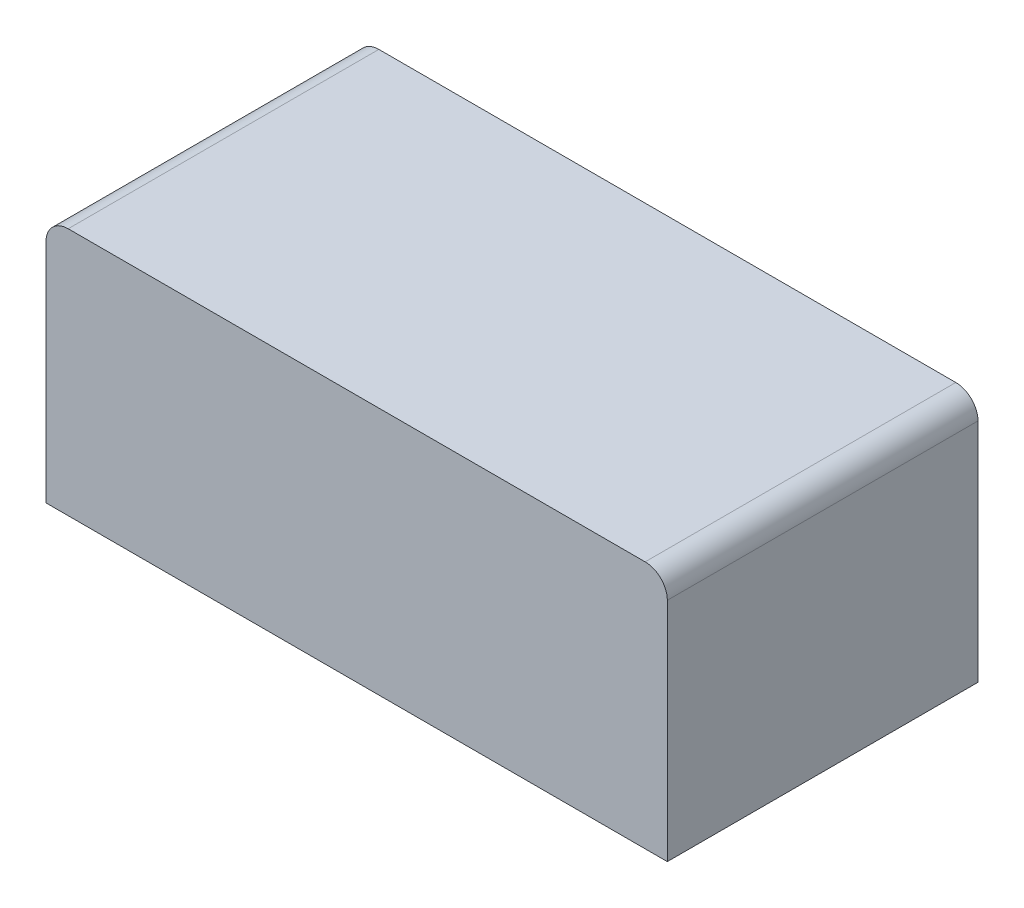
ISO-10303-21;
HEADER;
FILE_DESCRIPTION(('STEP AP214'),'2;1');
FILE_NAME('part.step','',(''),(''),'','','');
FILE_SCHEMA(('AUTOMOTIVE_DESIGN { 1 0 10303 214 1 1 1 1 }'));
ENDSEC;
DATA;
#1=APPLICATION_CONTEXT('core data for automotive mechanical design processes');
#2=APPLICATION_PROTOCOL_DEFINITION('international standard','automotive_design',2000,#1);
#3=PRODUCT_CONTEXT('',#1,'mechanical');
#4=PRODUCT('Part','Part','',(#3));
#5=PRODUCT_RELATED_PRODUCT_CATEGORY('part','',(#4));
#6=PRODUCT_DEFINITION_FORMATION('','',#4);
#7=PRODUCT_DEFINITION_CONTEXT('part definition',#1,'design');
#8=PRODUCT_DEFINITION('design','',#6,#7);
#9=PRODUCT_DEFINITION_SHAPE('','',#8);
#10=(LENGTH_UNIT() NAMED_UNIT(*) SI_UNIT(.MILLI.,.METRE.));
#11=(NAMED_UNIT(*) PLANE_ANGLE_UNIT() SI_UNIT($,.RADIAN.));
#12=(NAMED_UNIT(*) SI_UNIT($,.STERADIAN.) SOLID_ANGLE_UNIT());
#13=UNCERTAINTY_MEASURE_WITH_UNIT(LENGTH_MEASURE(1.E-05),#10,'distance_accuracy_value','');
#14=(GEOMETRIC_REPRESENTATION_CONTEXT(3) GLOBAL_UNCERTAINTY_ASSIGNED_CONTEXT((#13)) GLOBAL_UNIT_ASSIGNED_CONTEXT((#10,
#11,#12)) REPRESENTATION_CONTEXT('',''));
#15=CARTESIAN_POINT('',(0.,0.,0.));
#16=DIRECTION('',(0.,0.,1.));
#17=DIRECTION('',(1.,0.,0.));
#18=AXIS2_PLACEMENT_3D('',#15,#16,#17);
#19=CARTESIAN_POINT('',(24.1335140873094,-3.67124998633488,-5.58808410698079));
#20=DIRECTION('',(0.,0.,1.));
#21=DIRECTION('',(1.,0.,0.));
#22=AXIS2_PLACEMENT_3D('',#19,#20,#21);
#23=CYLINDRICAL_SURFACE('',#22,0.1);
#24=CARTESIAN_POINT('',(24.1335140873094,-3.67124998633488,-5.58808410698079));
#25=DIRECTION('',(0.,0.,1.));
#26=DIRECTION('',(1.,0.,0.));
#27=AXIS2_PLACEMENT_3D('',#24,#25,#26);
#28=CIRCLE('',#27,0.1);
#29=CARTESIAN_POINT('',(24.0335140873094,-3.67124998633488,-5.58808410698079));
#30=VERTEX_POINT('',#29);
#31=CARTESIAN_POINT('',(24.1335140873094,-3.57124998633488,-5.58808410698079));
#32=VERTEX_POINT('',#31);
#33=EDGE_CURVE('E98',#30,#32,#28,.F.);
#34=ORIENTED_EDGE('',*,*,#33,.T.);
#35=DIRECTION('',(0.,0.,-1.));
#36=VECTOR('',#35,1.);
#37=CARTESIAN_POINT('',(24.1335140873094,-3.57124998633488,-5.58808410698079));
#38=LINE('',#37,#36);
#39=CARTESIAN_POINT('',(24.1335140873094,-3.57124998633488,-6.98808410698078));
#40=VERTEX_POINT('',#39);
#41=EDGE_CURVE('E73',#32,#40,#38,.T.);
#42=ORIENTED_EDGE('',*,*,#41,.T.);
#43=CARTESIAN_POINT('',(24.1335140873094,-3.67124998633488,-6.98808410698079));
#44=DIRECTION('',(0.,0.,1.));
#45=DIRECTION('',(1.,0.,0.));
#46=AXIS2_PLACEMENT_3D('',#43,#44,#45);
#47=CIRCLE('',#46,0.1);
#48=CARTESIAN_POINT('',(24.0335140873094,-3.67124998633488,-6.98808410698078));
#49=VERTEX_POINT('',#48);
#50=EDGE_CURVE('E19',#40,#49,#47,.T.);
#51=ORIENTED_EDGE('',*,*,#50,.T.);
#52=DIRECTION('',(0.,0.,-1.));
#53=VECTOR('',#52,1.);
#54=CARTESIAN_POINT('',(24.0335140873094,-3.67124998633488,-5.58808410698079));
#55=LINE('',#54,#53);
#56=EDGE_CURVE('E70',#49,#30,#55,.F.);
#57=ORIENTED_EDGE('',*,*,#56,.T.);
#58=EDGE_LOOP('',(#34,#42,#51,#57));
#59=FACE_BOUND('',#58,.T.);
#60=ADVANCED_FACE('F16',(#59),#23,.T.);
#61=CARTESIAN_POINT('',(24.0335140873094,-3.57124998633488,-5.58808410698079));
#62=DIRECTION('',(0.,-1.,0.));
#63=DIRECTION('',(0.,0.,-1.));
#64=AXIS2_PLACEMENT_3D('',#61,#62,#63);
#65=PLANE('',#64);
#66=DIRECTION('',(0.,0.,-1.));
#67=VECTOR('',#66,1.);
#68=CARTESIAN_POINT('',(26.7335140873094,-3.57124998633488,-5.58808410698079));
#69=LINE('',#68,#67);
#70=CARTESIAN_POINT('',(26.7335140873094,-3.57124998633488,-6.98808410698078));
#71=VERTEX_POINT('',#70);
#72=CARTESIAN_POINT('',(26.7335140873094,-3.57124998633488,-5.58808410698079));
#73=VERTEX_POINT('',#72);
#74=EDGE_CURVE('E121',#71,#73,#69,.F.);
#75=ORIENTED_EDGE('',*,*,#74,.F.);
#76=DIRECTION('',(1.,0.,0.));
#77=VECTOR('',#76,1.);
#78=CARTESIAN_POINT('',(26.8335140873094,-3.57124998633488,-6.98808410698078));
#79=LINE('',#78,#77);
#80=EDGE_CURVE('E89',#71,#40,#79,.F.);
#81=ORIENTED_EDGE('',*,*,#80,.T.);
#82=ORIENTED_EDGE('',*,*,#41,.F.);
#83=DIRECTION('',(-1.,0.,0.));
#84=VECTOR('',#83,1.);
#85=CARTESIAN_POINT('',(26.8335140873094,-3.57124998633488,-5.58808410698079));
#86=LINE('',#85,#84);
#87=EDGE_CURVE('E96',#32,#73,#86,.F.);
#88=ORIENTED_EDGE('',*,*,#87,.T.);
#89=EDGE_LOOP('',(#75,#81,#82,#88));
#90=FACE_BOUND('',#89,.T.);
#91=ADVANCED_FACE('F132',(#90),#65,.F.);
#92=CARTESIAN_POINT('',(26.7335140873094,-3.67124998633488,-5.58808410698079));
#93=DIRECTION('',(0.,0.,-1.));
#94=DIRECTION('',(-1.,0.,0.));
#95=AXIS2_PLACEMENT_3D('',#92,#93,#94);
#96=CYLINDRICAL_SURFACE('',#95,0.1);
#97=CARTESIAN_POINT('',(26.7335140873094,-3.67124998633488,-6.98808410698078));
#98=DIRECTION('',(0.,0.,-1.));
#99=DIRECTION('',(-1.,0.,0.));
#100=AXIS2_PLACEMENT_3D('',#97,#98,#99);
#101=CIRCLE('',#100,0.1);
#102=CARTESIAN_POINT('',(26.8335140873094,-3.67124998633488,-6.98808410698078));
#103=VERTEX_POINT('',#102);
#104=EDGE_CURVE('E86',#103,#71,#101,.F.);
#105=ORIENTED_EDGE('',*,*,#104,.T.);
#106=ORIENTED_EDGE('',*,*,#74,.T.);
#107=CARTESIAN_POINT('',(26.7335140873094,-3.67124998633488,-5.58808410698079));
#108=DIRECTION('',(0.,0.,-1.));
#109=DIRECTION('',(-1.,0.,0.));
#110=AXIS2_PLACEMENT_3D('',#107,#108,#109);
#111=CIRCLE('',#110,0.1);
#112=CARTESIAN_POINT('',(26.8335140873094,-3.67124998633488,-5.58808410698079));
#113=VERTEX_POINT('',#112);
#114=EDGE_CURVE('E81',#73,#113,#111,.T.);
#115=ORIENTED_EDGE('',*,*,#114,.T.);
#116=DIRECTION('',(0.,0.,1.));
#117=VECTOR('',#116,1.);
#118=CARTESIAN_POINT('',(26.8335140873094,-3.67124998633488,-5.58808410698079));
#119=LINE('',#118,#117);
#120=EDGE_CURVE('E99',#113,#103,#119,.F.);
#121=ORIENTED_EDGE('',*,*,#120,.T.);
#122=EDGE_LOOP('',(#105,#106,#115,#121));
#123=FACE_BOUND('',#122,.T.);
#124=ADVANCED_FACE('F138',(#123),#96,.T.);
#125=CARTESIAN_POINT('',(26.8335140873094,-3.57124998633488,-5.58808410698079));
#126=DIRECTION('',(0.,0.,-1.));
#127=DIRECTION('',(-1.,0.,0.));
#128=AXIS2_PLACEMENT_3D('',#125,#126,#127);
#129=PLANE('',#128);
#130=ORIENTED_EDGE('',*,*,#114,.F.);
#131=ORIENTED_EDGE('',*,*,#87,.F.);
#132=ORIENTED_EDGE('',*,*,#33,.F.);
#133=DIRECTION('',(0.,1.,0.));
#134=VECTOR('',#133,1.);
#135=CARTESIAN_POINT('',(24.0335140873094,-3.57124998633488,-5.58808410698079));
#136=LINE('',#135,#134);
#137=CARTESIAN_POINT('',(24.0335140873094,-4.69124998633488,-5.58808410698079));
#138=VERTEX_POINT('',#137);
#139=EDGE_CURVE('E80',#30,#138,#136,.F.);
#140=ORIENTED_EDGE('',*,*,#139,.T.);
#141=DIRECTION('',(1.,0.,0.));
#142=VECTOR('',#141,1.);
#143=CARTESIAN_POINT('',(24.0335140873094,-4.69124998633488,-5.58808410698079));
#144=LINE('',#143,#142);
#145=CARTESIAN_POINT('',(26.8335140873094,-4.69124998633488,-5.58808410698079));
#146=VERTEX_POINT('',#145);
#147=EDGE_CURVE('E103',#146,#138,#144,.F.);
#148=ORIENTED_EDGE('',*,*,#147,.F.);
#149=DIRECTION('',(0.,1.,0.));
#150=VECTOR('',#149,1.);
#151=CARTESIAN_POINT('',(26.8335140873094,-3.57124998633488,-5.58808410698079));
#152=LINE('',#151,#150);
#153=EDGE_CURVE('E101',#146,#113,#152,.T.);
#154=ORIENTED_EDGE('',*,*,#153,.T.);
#155=EDGE_LOOP('',(#130,#131,#132,#140,#148,#154));
#156=FACE_BOUND('',#155,.T.);
#157=ADVANCED_FACE('F134',(#156),#129,.F.);
#158=CARTESIAN_POINT('',(24.0335140873094,-3.57124998633488,-5.58808410698079));
#159=DIRECTION('',(1.,0.,0.));
#160=DIRECTION('',(0.,0.,-1.));
#161=AXIS2_PLACEMENT_3D('',#158,#159,#160);
#162=PLANE('',#161);
#163=ORIENTED_EDGE('',*,*,#56,.F.);
#164=DIRECTION('',(0.,1.,0.));
#165=VECTOR('',#164,1.);
#166=CARTESIAN_POINT('',(24.0335140873094,-3.57124998633488,-6.98808410698078));
#167=LINE('',#166,#165);
#168=CARTESIAN_POINT('',(24.0335140873094,-4.69124998633488,-6.98808410698078));
#169=VERTEX_POINT('',#168);
#170=EDGE_CURVE('E79',#49,#169,#167,.F.);
#171=ORIENTED_EDGE('',*,*,#170,.T.);
#172=DIRECTION('',(0.,0.,-1.));
#173=VECTOR('',#172,1.);
#174=CARTESIAN_POINT('',(24.0335140873094,-4.69124998633488,-5.58808410698079));
#175=LINE('',#174,#173);
#176=EDGE_CURVE('E109',#138,#169,#175,.T.);
#177=ORIENTED_EDGE('',*,*,#176,.F.);
#178=ORIENTED_EDGE('',*,*,#139,.F.);
#179=EDGE_LOOP('',(#163,#171,#177,#178));
#180=FACE_BOUND('',#179,.T.);
#181=ADVANCED_FACE('F77',(#180),#162,.F.);
#182=CARTESIAN_POINT('',(26.8335140873094,-3.57124998633488,-6.98808410698078));
#183=DIRECTION('',(0.,0.,1.));
#184=DIRECTION('',(1.,0.,0.));
#185=AXIS2_PLACEMENT_3D('',#182,#183,#184);
#186=PLANE('',#185);
#187=ORIENTED_EDGE('',*,*,#104,.F.);
#188=DIRECTION('',(0.,1.,0.));
#189=VECTOR('',#188,1.);
#190=CARTESIAN_POINT('',(26.8335140873094,-3.57124998633488,-6.98808410698078));
#191=LINE('',#190,#189);
#192=CARTESIAN_POINT('',(26.8335140873094,-4.69124998633488,-6.98808410698078));
#193=VERTEX_POINT('',#192);
#194=EDGE_CURVE('E34',#103,#193,#191,.F.);
#195=ORIENTED_EDGE('',*,*,#194,.T.);
#196=DIRECTION('',(1.,0.,0.));
#197=VECTOR('',#196,1.);
#198=CARTESIAN_POINT('',(24.0335140873094,-4.69124998633488,-6.98808410698079));
#199=LINE('',#198,#197);
#200=EDGE_CURVE('E25',#169,#193,#199,.T.);
#201=ORIENTED_EDGE('',*,*,#200,.F.);
#202=ORIENTED_EDGE('',*,*,#170,.F.);
#203=ORIENTED_EDGE('',*,*,#50,.F.);
#204=ORIENTED_EDGE('',*,*,#80,.F.);
#205=EDGE_LOOP('',(#187,#195,#201,#202,#203,#204));
#206=FACE_BOUND('',#205,.T.);
#207=ADVANCED_FACE('F83',(#206),#186,.F.);
#208=CARTESIAN_POINT('',(26.8335140873094,-3.57124998633488,-5.58808410698079));
#209=DIRECTION('',(-1.,0.,0.));
#210=DIRECTION('',(0.,0.,1.));
#211=AXIS2_PLACEMENT_3D('',#208,#209,#210);
#212=PLANE('',#211);
#213=ORIENTED_EDGE('',*,*,#120,.F.);
#214=ORIENTED_EDGE('',*,*,#153,.F.);
#215=DIRECTION('',(0.,0.,-1.));
#216=VECTOR('',#215,1.);
#217=CARTESIAN_POINT('',(26.8335140873094,-4.69124998633488,-5.58808410698079));
#218=LINE('',#217,#216);
#219=EDGE_CURVE('E11',#193,#146,#218,.F.);
#220=ORIENTED_EDGE('',*,*,#219,.F.);
#221=ORIENTED_EDGE('',*,*,#194,.F.);
#222=EDGE_LOOP('',(#213,#214,#220,#221));
#223=FACE_BOUND('',#222,.T.);
#224=ADVANCED_FACE('F140',(#223),#212,.F.);
#225=CARTESIAN_POINT('',(24.0335140873094,-4.69124998633488,-5.58808410698079));
#226=DIRECTION('',(0.,-1.,0.));
#227=DIRECTION('',(0.,0.,-1.));
#228=AXIS2_PLACEMENT_3D('',#225,#226,#227);
#229=PLANE('',#228);
#230=ORIENTED_EDGE('',*,*,#200,.T.);
#231=ORIENTED_EDGE('',*,*,#219,.T.);
#232=ORIENTED_EDGE('',*,*,#147,.T.);
#233=ORIENTED_EDGE('',*,*,#176,.T.);
#234=EDGE_LOOP('',(#230,#231,#232,#233));
#235=FACE_BOUND('',#234,.T.);
#236=ADVANCED_FACE('F142',(#235),#229,.T.);
#237=CLOSED_SHELL('',(#60,#91,#124,#157,#181,#207,#224,#236));
#238=MANIFOLD_SOLID_BREP('B1',#237);
#239=ADVANCED_BREP_SHAPE_REPRESENTATION('',(#18,#238),#14);
#240=SHAPE_DEFINITION_REPRESENTATION(#9,#239);
ENDSEC;
END-ISO-10303-21;
